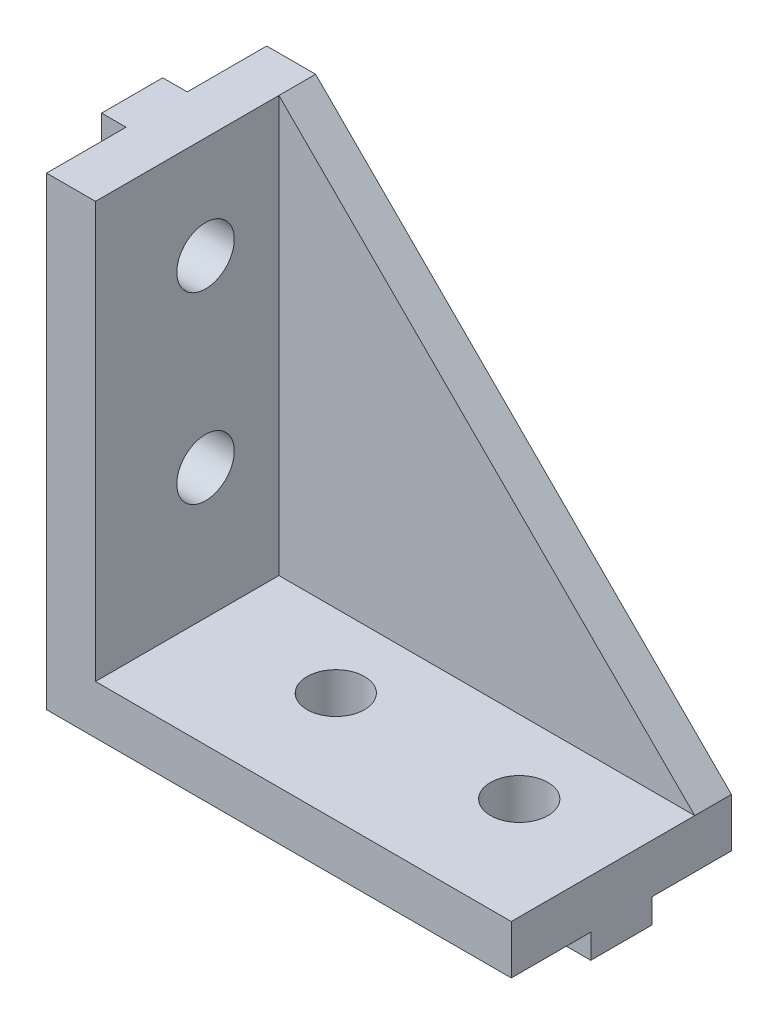
ISO-10303-21;
HEADER;
FILE_DESCRIPTION(('STEP AP214'),'2;1');
FILE_NAME('part.step','',(''),(''),'','','');
FILE_SCHEMA(('AUTOMOTIVE_DESIGN { 1 0 10303 214 1 1 1 1 }'));
ENDSEC;
DATA;
#1=APPLICATION_CONTEXT('core data for automotive mechanical design processes');
#2=APPLICATION_PROTOCOL_DEFINITION('international standard','automotive_design',2000,#1);
#3=PRODUCT_CONTEXT('',#1,'mechanical');
#4=PRODUCT('Part','Part','',(#3));
#5=PRODUCT_RELATED_PRODUCT_CATEGORY('part','',(#4));
#6=PRODUCT_DEFINITION_FORMATION('','',#4);
#7=PRODUCT_DEFINITION_CONTEXT('part definition',#1,'design');
#8=PRODUCT_DEFINITION('design','',#6,#7);
#9=PRODUCT_DEFINITION_SHAPE('','',#8);
#10=(LENGTH_UNIT() NAMED_UNIT(*) SI_UNIT(.MILLI.,.METRE.));
#11=(NAMED_UNIT(*) PLANE_ANGLE_UNIT() SI_UNIT($,.RADIAN.));
#12=(NAMED_UNIT(*) SI_UNIT($,.STERADIAN.) SOLID_ANGLE_UNIT());
#13=UNCERTAINTY_MEASURE_WITH_UNIT(LENGTH_MEASURE(1.E-05),#10,'distance_accuracy_value','');
#14=(GEOMETRIC_REPRESENTATION_CONTEXT(3) GLOBAL_UNCERTAINTY_ASSIGNED_CONTEXT((#13)) GLOBAL_UNIT_ASSIGNED_CONTEXT((#10,
#11,#12)) REPRESENTATION_CONTEXT('',''));
#15=CARTESIAN_POINT('',(0.,0.,0.));
#16=DIRECTION('',(0.,0.,1.));
#17=DIRECTION('',(1.,0.,0.));
#18=AXIS2_PLACEMENT_3D('',#15,#16,#17);
#19=CARTESIAN_POINT('',(0.,38.,9.));
#20=DIRECTION('',(1.,0.,0.));
#21=DIRECTION('',(0.,1.,0.));
#22=AXIS2_PLACEMENT_3D('',#19,#20,#21);
#23=PLANE('',#22);
#24=CARTESIAN_POINT('',(0.,29.65,0.));
#25=DIRECTION('',(-1.,0.,0.));
#26=DIRECTION('',(0.,0.,1.));
#27=AXIS2_PLACEMENT_3D('',#24,#25,#26);
#28=CIRCLE('',#27,2.35);
#29=CARTESIAN_POINT('',(0.,29.65,2.35));
#30=VERTEX_POINT('',#29);
#31=EDGE_CURVE('E267',#30,#30,#28,.T.);
#32=ORIENTED_EDGE('',*,*,#31,.F.);
#33=EDGE_LOOP('',(#32));
#34=FACE_BOUND('',#33,.T.);
#35=CARTESIAN_POINT('',(0.,14.65,0.));
#36=DIRECTION('',(-1.,0.,0.));
#37=DIRECTION('',(0.,0.,1.));
#38=AXIS2_PLACEMENT_3D('',#35,#36,#37);
#39=CIRCLE('',#38,2.35);
#40=CARTESIAN_POINT('',(0.,14.65,2.35));
#41=VERTEX_POINT('',#40);
#42=EDGE_CURVE('E260',#41,#41,#39,.T.);
#43=ORIENTED_EDGE('',*,*,#42,.F.);
#44=EDGE_LOOP('',(#43));
#45=FACE_BOUND('',#44,.T.);
#46=DIRECTION('',(0.,0.,-1.));
#47=VECTOR('',#46,1.);
#48=CARTESIAN_POINT('',(0.,36.,-2.49999999999998));
#49=LINE('',#48,#47);
#50=CARTESIAN_POINT('',(0.,36.,2.50000000000002));
#51=VERTEX_POINT('',#50);
#52=CARTESIAN_POINT('',(0.,36.,-2.49999999999998));
#53=VERTEX_POINT('',#52);
#54=EDGE_CURVE('E219',#51,#53,#49,.T.);
#55=ORIENTED_EDGE('',*,*,#54,.T.);
#56=DIRECTION('',(0.,1.,0.));
#57=VECTOR('',#56,1.);
#58=CARTESIAN_POINT('',(0.,36.,-2.49999999999998));
#59=LINE('',#58,#57);
#60=CARTESIAN_POINT('',(0.,38.,-2.49999999999998));
#61=VERTEX_POINT('',#60);
#62=EDGE_CURVE('E217',#53,#61,#59,.T.);
#63=ORIENTED_EDGE('',*,*,#62,.T.);
#64=DIRECTION('',(0.,0.,-1.));
#65=VECTOR('',#64,1.);
#66=CARTESIAN_POINT('',(0.,38.,9.));
#67=LINE('',#66,#65);
#68=CARTESIAN_POINT('',(0.,38.,-9.));
#69=VERTEX_POINT('',#68);
#70=EDGE_CURVE('E43',#61,#69,#67,.T.);
#71=ORIENTED_EDGE('',*,*,#70,.T.);
#72=DIRECTION('',(0.,-1.,0.));
#73=VECTOR('',#72,1.);
#74=CARTESIAN_POINT('',(0.,38.,-9.));
#75=LINE('',#74,#73);
#76=CARTESIAN_POINT('',(0.,0.,-9.));
#77=VERTEX_POINT('',#76);
#78=EDGE_CURVE('E356',#69,#77,#75,.T.);
#79=ORIENTED_EDGE('',*,*,#78,.T.);
#80=DIRECTION('',(0.,0.,-1.));
#81=VECTOR('',#80,1.);
#82=CARTESIAN_POINT('',(0.,0.,9.));
#83=LINE('',#82,#81);
#84=CARTESIAN_POINT('',(0.,0.,-2.5));
#85=VERTEX_POINT('',#84);
#86=EDGE_CURVE('E372',#85,#77,#83,.T.);
#87=ORIENTED_EDGE('',*,*,#86,.F.);
#88=DIRECTION('',(0.,1.,0.));
#89=VECTOR('',#88,1.);
#90=CARTESIAN_POINT('',(0.,0.,-2.5));
#91=LINE('',#90,#89);
#92=CARTESIAN_POINT('',(0.,2.,-2.5));
#93=VERTEX_POINT('',#92);
#94=EDGE_CURVE('E243',#85,#93,#91,.T.);
#95=ORIENTED_EDGE('',*,*,#94,.T.);
#96=DIRECTION('',(0.,0.,1.));
#97=VECTOR('',#96,1.);
#98=CARTESIAN_POINT('',(0.,2.,-2.5));
#99=LINE('',#98,#97);
#100=CARTESIAN_POINT('',(0.,2.,2.5));
#101=VERTEX_POINT('',#100);
#102=EDGE_CURVE('E195',#93,#101,#99,.T.);
#103=ORIENTED_EDGE('',*,*,#102,.T.);
#104=DIRECTION('',(0.,-1.,0.));
#105=VECTOR('',#104,1.);
#106=CARTESIAN_POINT('',(0.,0.,2.5));
#107=LINE('',#106,#105);
#108=CARTESIAN_POINT('',(0.,0.,2.5));
#109=VERTEX_POINT('',#108);
#110=EDGE_CURVE('E231',#101,#109,#107,.T.);
#111=ORIENTED_EDGE('',*,*,#110,.T.);
#112=CARTESIAN_POINT('',(0.,0.,9.));
#113=VERTEX_POINT('',#112);
#114=EDGE_CURVE('E373',#113,#109,#83,.T.);
#115=ORIENTED_EDGE('',*,*,#114,.F.);
#116=DIRECTION('',(0.,-1.,0.));
#117=VECTOR('',#116,1.);
#118=CARTESIAN_POINT('',(0.,38.,9.));
#119=LINE('',#118,#117);
#120=CARTESIAN_POINT('',(0.,38.,9.));
#121=VERTEX_POINT('',#120);
#122=EDGE_CURVE('E343',#121,#113,#119,.T.);
#123=ORIENTED_EDGE('',*,*,#122,.F.);
#124=CARTESIAN_POINT('',(0.,38.,2.50000000000002));
#125=VERTEX_POINT('',#124);
#126=EDGE_CURVE('E11',#121,#125,#67,.T.);
#127=ORIENTED_EDGE('',*,*,#126,.T.);
#128=DIRECTION('',(0.,-1.,0.));
#129=VECTOR('',#128,1.);
#130=CARTESIAN_POINT('',(0.,36.,2.50000000000002));
#131=LINE('',#130,#129);
#132=EDGE_CURVE('E206',#125,#51,#131,.T.);
#133=ORIENTED_EDGE('',*,*,#132,.T.);
#134=EDGE_LOOP('',(#55,#63,#71,#79,#87,#95,#103,#111,#115,#123,#127,#133));
#135=FACE_BOUND('',#134,.T.);
#136=ADVANCED_FACE('F35',(#34,#45,#135),#23,.F.);
#137=CARTESIAN_POINT('',(0.,0.,9.));
#138=DIRECTION('',(0.,1.,0.));
#139=DIRECTION('',(0.,0.,1.));
#140=AXIS2_PLACEMENT_3D('',#137,#138,#139);
#141=PLANE('',#140);
#142=CARTESIAN_POINT('',(14.65,0.,0.));
#143=DIRECTION('',(0.,1.,0.));
#144=DIRECTION('',(0.,0.,1.));
#145=AXIS2_PLACEMENT_3D('',#142,#143,#144);
#146=CIRCLE('',#145,2.35);
#147=CARTESIAN_POINT('',(14.65,0.,2.35));
#148=VERTEX_POINT('',#147);
#149=EDGE_CURVE('E328',#148,#148,#146,.T.);
#150=ORIENTED_EDGE('',*,*,#149,.T.);
#151=EDGE_LOOP('',(#150));
#152=FACE_BOUND('',#151,.T.);
#153=CARTESIAN_POINT('',(29.65,0.,0.));
#154=DIRECTION('',(0.,1.,0.));
#155=DIRECTION('',(0.,0.,1.));
#156=AXIS2_PLACEMENT_3D('',#153,#154,#155);
#157=CIRCLE('',#156,2.35);
#158=CARTESIAN_POINT('',(29.65,0.,2.35));
#159=VERTEX_POINT('',#158);
#160=EDGE_CURVE('E335',#159,#159,#157,.T.);
#161=ORIENTED_EDGE('',*,*,#160,.T.);
#162=EDGE_LOOP('',(#161));
#163=FACE_BOUND('',#162,.T.);
#164=DIRECTION('',(-1.,0.,0.));
#165=VECTOR('',#164,1.);
#166=CARTESIAN_POINT('',(36.,0.,2.50000000000002));
#167=LINE('',#166,#165);
#168=CARTESIAN_POINT('',(38.,0.,2.50000000000002));
#169=VERTEX_POINT('',#168);
#170=CARTESIAN_POINT('',(36.,0.,2.50000000000002));
#171=VERTEX_POINT('',#170);
#172=EDGE_CURVE('E263',#169,#171,#167,.T.);
#173=ORIENTED_EDGE('',*,*,#172,.F.);
#174=DIRECTION('',(0.,0.,-1.));
#175=VECTOR('',#174,1.);
#176=CARTESIAN_POINT('',(38.,0.,9.));
#177=LINE('',#176,#175);
#178=CARTESIAN_POINT('',(38.,0.,9.));
#179=VERTEX_POINT('',#178);
#180=EDGE_CURVE('E370',#179,#169,#177,.T.);
#181=ORIENTED_EDGE('',*,*,#180,.F.);
#182=DIRECTION('',(1.,0.,0.));
#183=VECTOR('',#182,1.);
#184=CARTESIAN_POINT('',(0.,0.,9.));
#185=LINE('',#184,#183);
#186=EDGE_CURVE('E346',#113,#179,#185,.T.);
#187=ORIENTED_EDGE('',*,*,#186,.F.);
#188=ORIENTED_EDGE('',*,*,#114,.T.);
#189=DIRECTION('',(-1.,0.,0.));
#190=VECTOR('',#189,1.);
#191=CARTESIAN_POINT('',(0.,0.,2.5));
#192=LINE('',#191,#190);
#193=CARTESIAN_POINT('',(2.,0.,2.5));
#194=VERTEX_POINT('',#193);
#195=EDGE_CURVE('E311',#194,#109,#192,.T.);
#196=ORIENTED_EDGE('',*,*,#195,.F.);
#197=DIRECTION('',(0.,0.,1.));
#198=VECTOR('',#197,1.);
#199=CARTESIAN_POINT('',(2.,0.,-2.5));
#200=LINE('',#199,#198);
#201=CARTESIAN_POINT('',(2.,0.,-2.5));
#202=VERTEX_POINT('',#201);
#203=EDGE_CURVE('E297',#202,#194,#200,.T.);
#204=ORIENTED_EDGE('',*,*,#203,.F.);
#205=DIRECTION('',(1.,0.,0.));
#206=VECTOR('',#205,1.);
#207=CARTESIAN_POINT('',(0.,0.,-2.5));
#208=LINE('',#207,#206);
#209=EDGE_CURVE('E302',#85,#202,#208,.T.);
#210=ORIENTED_EDGE('',*,*,#209,.F.);
#211=ORIENTED_EDGE('',*,*,#86,.T.);
#212=DIRECTION('',(1.,0.,0.));
#213=VECTOR('',#212,1.);
#214=CARTESIAN_POINT('',(0.,0.,-9.));
#215=LINE('',#214,#213);
#216=CARTESIAN_POINT('',(38.,0.,-9.));
#217=VERTEX_POINT('',#216);
#218=EDGE_CURVE('E359',#77,#217,#215,.T.);
#219=ORIENTED_EDGE('',*,*,#218,.T.);
#220=CARTESIAN_POINT('',(38.,0.,-2.49999999999998));
#221=VERTEX_POINT('',#220);
#222=EDGE_CURVE('E369',#221,#217,#177,.T.);
#223=ORIENTED_EDGE('',*,*,#222,.F.);
#224=DIRECTION('',(1.,0.,0.));
#225=VECTOR('',#224,1.);
#226=CARTESIAN_POINT('',(36.,0.,-2.49999999999998));
#227=LINE('',#226,#225);
#228=CARTESIAN_POINT('',(36.,0.,-2.49999999999998));
#229=VERTEX_POINT('',#228);
#230=EDGE_CURVE('E276',#229,#221,#227,.T.);
#231=ORIENTED_EDGE('',*,*,#230,.F.);
#232=DIRECTION('',(0.,0.,-1.));
#233=VECTOR('',#232,1.);
#234=CARTESIAN_POINT('',(36.,0.,-2.49999999999998));
#235=LINE('',#234,#233);
#236=EDGE_CURVE('E284',#171,#229,#235,.T.);
#237=ORIENTED_EDGE('',*,*,#236,.F.);
#238=EDGE_LOOP('',(#173,#181,#187,#188,#196,#204,#210,#211,#219,#223,#231,#237));
#239=FACE_BOUND('',#238,.T.);
#240=ADVANCED_FACE('F381',(#152,#163,#239),#141,.F.);
#241=CARTESIAN_POINT('',(4.,38.,9.));
#242=DIRECTION('',(0.,-1.,0.));
#243=DIRECTION('',(0.,0.,-1.));
#244=AXIS2_PLACEMENT_3D('',#241,#242,#243);
#245=PLANE('',#244);
#246=DIRECTION('',(-1.,0.,0.));
#247=VECTOR('',#246,1.);
#248=CARTESIAN_POINT('',(4.,38.,-9.));
#249=LINE('',#248,#247);
#250=CARTESIAN_POINT('',(4.,38.,-9.));
#251=VERTEX_POINT('',#250);
#252=EDGE_CURVE('E331',#251,#69,#249,.T.);
#253=ORIENTED_EDGE('',*,*,#252,.T.);
#254=ORIENTED_EDGE('',*,*,#70,.F.);
#255=DIRECTION('',(1.,0.,0.));
#256=VECTOR('',#255,1.);
#257=CARTESIAN_POINT('',(-1.99999999999999,38.,-2.49999999999998));
#258=LINE('',#257,#256);
#259=CARTESIAN_POINT('',(-1.99999999999999,38.,-2.49999999999998));
#260=VERTEX_POINT('',#259);
#261=EDGE_CURVE('E185',#260,#61,#258,.T.);
#262=ORIENTED_EDGE('',*,*,#261,.F.);
#263=DIRECTION('',(0.,0.,1.));
#264=VECTOR('',#263,1.);
#265=CARTESIAN_POINT('',(-1.99999999999999,38.,-2.49999999999998));
#266=LINE('',#265,#264);
#267=CARTESIAN_POINT('',(-1.99999999999999,38.,2.50000000000002));
#268=VERTEX_POINT('',#267);
#269=EDGE_CURVE('E189',#260,#268,#266,.T.);
#270=ORIENTED_EDGE('',*,*,#269,.T.);
#271=DIRECTION('',(1.,0.,0.));
#272=VECTOR('',#271,1.);
#273=CARTESIAN_POINT('',(-1.99999999999999,38.,2.50000000000002));
#274=LINE('',#273,#272);
#275=EDGE_CURVE('E216',#268,#125,#274,.T.);
#276=ORIENTED_EDGE('',*,*,#275,.T.);
#277=ORIENTED_EDGE('',*,*,#126,.F.);
#278=DIRECTION('',(-1.,0.,0.));
#279=VECTOR('',#278,1.);
#280=CARTESIAN_POINT('',(4.,38.,9.));
#281=LINE('',#280,#279);
#282=CARTESIAN_POINT('',(4.,38.,9.));
#283=VERTEX_POINT('',#282);
#284=EDGE_CURVE('E340',#283,#121,#281,.T.);
#285=ORIENTED_EDGE('',*,*,#284,.F.);
#286=DIRECTION('',(0.,0.,-1.));
#287=VECTOR('',#286,1.);
#288=CARTESIAN_POINT('',(4.,38.,9.));
#289=LINE('',#288,#287);
#290=CARTESIAN_POINT('',(4.,38.,-6.));
#291=VERTEX_POINT('',#290);
#292=EDGE_CURVE('E354',#283,#291,#289,.T.);
#293=ORIENTED_EDGE('',*,*,#292,.T.);
#294=DIRECTION('',(0.,0.,-1.));
#295=VECTOR('',#294,1.);
#296=CARTESIAN_POINT('',(4.,38.,-6.));
#297=LINE('',#296,#295);
#298=EDGE_CURVE('E400',#291,#251,#297,.T.);
#299=ORIENTED_EDGE('',*,*,#298,.T.);
#300=EDGE_LOOP('',(#253,#254,#262,#270,#276,#277,#285,#293,#299));
#301=FACE_BOUND('',#300,.T.);
#302=ADVANCED_FACE('F37',(#301),#245,.F.);
#303=DIRECTION('',(0.,1.,0.));
#304=VECTOR('',#303,1.);
#305=CARTESIAN_POINT('',(0.,-2.,2.5));
#306=LINE('',#305,#304);
#307=CARTESIAN_POINT('',(0.,-2.,2.5));
#308=VERTEX_POINT('',#307);
#309=EDGE_CURVE('E321',#308,#109,#306,.T.);
#310=ORIENTED_EDGE('',*,*,#309,.T.);
#311=DIRECTION('',(0.,0.,-1.));
#312=VECTOR('',#311,1.);
#313=CARTESIAN_POINT('',(0.,0.,-2.5));
#314=LINE('',#313,#312);
#315=EDGE_CURVE('E246',#109,#85,#314,.T.);
#316=ORIENTED_EDGE('',*,*,#315,.T.);
#317=DIRECTION('',(0.,1.,0.));
#318=VECTOR('',#317,1.);
#319=CARTESIAN_POINT('',(0.,-2.,-2.5));
#320=LINE('',#319,#318);
#321=CARTESIAN_POINT('',(0.,-2.,-2.5));
#322=VERTEX_POINT('',#321);
#323=EDGE_CURVE('E318',#322,#85,#320,.T.);
#324=ORIENTED_EDGE('',*,*,#323,.F.);
#325=DIRECTION('',(0.,0.,-1.));
#326=VECTOR('',#325,1.);
#327=CARTESIAN_POINT('',(0.,-2.,-2.5));
#328=LINE('',#327,#326);
#329=EDGE_CURVE('E304',#308,#322,#328,.T.);
#330=ORIENTED_EDGE('',*,*,#329,.F.);
#331=EDGE_LOOP('',(#310,#316,#324,#330));
#332=FACE_BOUND('',#331,.T.);
#333=ADVANCED_FACE('F430',(#332),#23,.F.);
#334=CARTESIAN_POINT('',(38.,0.,9.));
#335=DIRECTION('',(-1.,0.,0.));
#336=DIRECTION('',(0.,0.,1.));
#337=AXIS2_PLACEMENT_3D('',#334,#335,#336);
#338=PLANE('',#337);
#339=DIRECTION('',(0.,1.,0.));
#340=VECTOR('',#339,1.);
#341=CARTESIAN_POINT('',(38.,0.,-9.));
#342=LINE('',#341,#340);
#343=CARTESIAN_POINT('',(38.,4.,-9.));
#344=VERTEX_POINT('',#343);
#345=EDGE_CURVE('E344',#217,#344,#342,.T.);
#346=ORIENTED_EDGE('',*,*,#345,.T.);
#347=DIRECTION('',(0.,0.,-1.));
#348=VECTOR('',#347,1.);
#349=CARTESIAN_POINT('',(38.,4.,-6.));
#350=LINE('',#349,#348);
#351=CARTESIAN_POINT('',(38.,4.,-6.));
#352=VERTEX_POINT('',#351);
#353=EDGE_CURVE('E50',#352,#344,#350,.T.);
#354=ORIENTED_EDGE('',*,*,#353,.F.);
#355=DIRECTION('',(0.,0.,-1.));
#356=VECTOR('',#355,1.);
#357=CARTESIAN_POINT('',(38.,4.,9.));
#358=LINE('',#357,#356);
#359=CARTESIAN_POINT('',(38.,4.,9.));
#360=VERTEX_POINT('',#359);
#361=EDGE_CURVE('E367',#360,#352,#358,.T.);
#362=ORIENTED_EDGE('',*,*,#361,.F.);
#363=DIRECTION('',(0.,1.,0.));
#364=VECTOR('',#363,1.);
#365=CARTESIAN_POINT('',(38.,0.,9.));
#366=LINE('',#365,#364);
#367=EDGE_CURVE('E348',#179,#360,#366,.T.);
#368=ORIENTED_EDGE('',*,*,#367,.F.);
#369=ORIENTED_EDGE('',*,*,#180,.T.);
#370=DIRECTION('',(0.,1.,0.));
#371=VECTOR('',#370,1.);
#372=CARTESIAN_POINT('',(38.,-2.,2.50000000000002));
#373=LINE('',#372,#371);
#374=CARTESIAN_POINT('',(38.,-2.,2.50000000000002));
#375=VERTEX_POINT('',#374);
#376=EDGE_CURVE('E295',#375,#169,#373,.T.);
#377=ORIENTED_EDGE('',*,*,#376,.F.);
#378=DIRECTION('',(0.,0.,1.));
#379=VECTOR('',#378,1.);
#380=CARTESIAN_POINT('',(38.,-2.,-2.49999999999998));
#381=LINE('',#380,#379);
#382=CARTESIAN_POINT('',(38.,-2.,-2.49999999999998));
#383=VERTEX_POINT('',#382);
#384=EDGE_CURVE('E272',#383,#375,#381,.T.);
#385=ORIENTED_EDGE('',*,*,#384,.F.);
#386=DIRECTION('',(0.,1.,0.));
#387=VECTOR('',#386,1.);
#388=CARTESIAN_POINT('',(38.,-2.,-2.49999999999998));
#389=LINE('',#388,#387);
#390=EDGE_CURVE('E282',#383,#221,#389,.T.);
#391=ORIENTED_EDGE('',*,*,#390,.T.);
#392=ORIENTED_EDGE('',*,*,#222,.T.);
#393=EDGE_LOOP('',(#346,#354,#362,#368,#369,#377,#385,#391,#392));
#394=FACE_BOUND('',#393,.T.);
#395=ADVANCED_FACE('F393',(#394),#338,.F.);
#396=CARTESIAN_POINT('',(4.,4.,9.));
#397=DIRECTION('',(0.,-1.,0.));
#398=DIRECTION('',(0.,0.,-1.));
#399=AXIS2_PLACEMENT_3D('',#396,#397,#398);
#400=PLANE('',#399);
#401=CARTESIAN_POINT('',(14.65,4.,0.));
#402=DIRECTION('',(0.,1.,0.));
#403=DIRECTION('',(0.,0.,1.));
#404=AXIS2_PLACEMENT_3D('',#401,#402,#403);
#405=CIRCLE('',#404,2.35);
#406=CARTESIAN_POINT('',(14.65,4.,2.35));
#407=VERTEX_POINT('',#406);
#408=EDGE_CURVE('E332',#407,#407,#405,.T.);
#409=ORIENTED_EDGE('',*,*,#408,.F.);
#410=EDGE_LOOP('',(#409));
#411=FACE_BOUND('',#410,.T.);
#412=CARTESIAN_POINT('',(29.65,4.,0.));
#413=DIRECTION('',(0.,1.,0.));
#414=DIRECTION('',(0.,0.,1.));
#415=AXIS2_PLACEMENT_3D('',#412,#413,#414);
#416=CIRCLE('',#415,2.35);
#417=CARTESIAN_POINT('',(29.65,4.,2.35));
#418=VERTEX_POINT('',#417);
#419=EDGE_CURVE('E327',#418,#418,#416,.T.);
#420=ORIENTED_EDGE('',*,*,#419,.F.);
#421=EDGE_LOOP('',(#420));
#422=FACE_BOUND('',#421,.T.);
#423=ORIENTED_EDGE('',*,*,#361,.T.);
#424=DIRECTION('',(1.,0.,0.));
#425=VECTOR('',#424,1.);
#426=CARTESIAN_POINT('',(38.,4.,-6.));
#427=LINE('',#426,#425);
#428=CARTESIAN_POINT('',(4.,4.,-6.));
#429=VERTEX_POINT('',#428);
#430=EDGE_CURVE('E57',#429,#352,#427,.T.);
#431=ORIENTED_EDGE('',*,*,#430,.F.);
#432=DIRECTION('',(0.,0.,-1.));
#433=VECTOR('',#432,1.);
#434=CARTESIAN_POINT('',(4.,4.,9.));
#435=LINE('',#434,#433);
#436=CARTESIAN_POINT('',(4.,4.,9.));
#437=VERTEX_POINT('',#436);
#438=EDGE_CURVE('E365',#437,#429,#435,.T.);
#439=ORIENTED_EDGE('',*,*,#438,.F.);
#440=DIRECTION('',(-1.,0.,0.));
#441=VECTOR('',#440,1.);
#442=CARTESIAN_POINT('',(4.,4.,9.));
#443=LINE('',#442,#441);
#444=EDGE_CURVE('E350',#360,#437,#443,.T.);
#445=ORIENTED_EDGE('',*,*,#444,.F.);
#446=EDGE_LOOP('',(#423,#431,#439,#445));
#447=FACE_BOUND('',#446,.T.);
#448=ADVANCED_FACE('F420',(#411,#422,#447),#400,.F.);
#449=CARTESIAN_POINT('',(4.,38.,9.));
#450=DIRECTION('',(-1.,0.,0.));
#451=DIRECTION('',(0.,-1.,0.));
#452=AXIS2_PLACEMENT_3D('',#449,#450,#451);
#453=PLANE('',#452);
#454=CARTESIAN_POINT('',(4.,14.65,0.));
#455=DIRECTION('',(-1.,0.,0.));
#456=DIRECTION('',(0.,0.,1.));
#457=AXIS2_PLACEMENT_3D('',#454,#455,#456);
#458=CIRCLE('',#457,2.35);
#459=CARTESIAN_POINT('',(4.,14.65,2.35));
#460=VERTEX_POINT('',#459);
#461=EDGE_CURVE('E264',#460,#460,#458,.T.);
#462=ORIENTED_EDGE('',*,*,#461,.T.);
#463=EDGE_LOOP('',(#462));
#464=FACE_BOUND('',#463,.T.);
#465=CARTESIAN_POINT('',(4.00000000000001,29.65,0.));
#466=DIRECTION('',(-1.,0.,0.));
#467=DIRECTION('',(0.,0.,1.));
#468=AXIS2_PLACEMENT_3D('',#465,#466,#467);
#469=CIRCLE('',#468,2.35);
#470=CARTESIAN_POINT('',(4.00000000000001,29.65,2.35));
#471=VERTEX_POINT('',#470);
#472=EDGE_CURVE('E259',#471,#471,#469,.T.);
#473=ORIENTED_EDGE('',*,*,#472,.T.);
#474=EDGE_LOOP('',(#473));
#475=FACE_BOUND('',#474,.T.);
#476=ORIENTED_EDGE('',*,*,#438,.T.);
#477=DIRECTION('',(0.,-1.,0.));
#478=VECTOR('',#477,1.);
#479=CARTESIAN_POINT('',(4.,4.,-6.));
#480=LINE('',#479,#478);
#481=EDGE_CURVE('E404',#291,#429,#480,.T.);
#482=ORIENTED_EDGE('',*,*,#481,.F.);
#483=ORIENTED_EDGE('',*,*,#292,.F.);
#484=DIRECTION('',(0.,1.,0.));
#485=VECTOR('',#484,1.);
#486=CARTESIAN_POINT('',(4.,38.,9.));
#487=LINE('',#486,#485);
#488=EDGE_CURVE('E352',#437,#283,#487,.T.);
#489=ORIENTED_EDGE('',*,*,#488,.F.);
#490=EDGE_LOOP('',(#476,#482,#483,#489));
#491=FACE_BOUND('',#490,.T.);
#492=ADVANCED_FACE('F412',(#464,#475,#491),#453,.F.);
#493=CARTESIAN_POINT('',(0.,0.,9.));
#494=DIRECTION('',(0.,0.,1.));
#495=DIRECTION('',(1.,0.,0.));
#496=AXIS2_PLACEMENT_3D('',#493,#494,#495);
#497=PLANE('',#496);
#498=ORIENTED_EDGE('',*,*,#284,.T.);
#499=ORIENTED_EDGE('',*,*,#122,.T.);
#500=ORIENTED_EDGE('',*,*,#186,.T.);
#501=ORIENTED_EDGE('',*,*,#367,.T.);
#502=ORIENTED_EDGE('',*,*,#444,.T.);
#503=ORIENTED_EDGE('',*,*,#488,.T.);
#504=EDGE_LOOP('',(#498,#499,#500,#501,#502,#503));
#505=FACE_BOUND('',#504,.T.);
#506=ADVANCED_FACE('F417',(#505),#497,.T.);
#507=CARTESIAN_POINT('',(0.,0.,-9.));
#508=DIRECTION('',(0.,0.,1.));
#509=DIRECTION('',(1.,0.,0.));
#510=AXIS2_PLACEMENT_3D('',#507,#508,#509);
#511=PLANE('',#510);
#512=ORIENTED_EDGE('',*,*,#252,.F.);
#513=DIRECTION('',(-0.707106781186547,0.707106781186547,0.));
#514=VECTOR('',#513,1.);
#515=CARTESIAN_POINT('',(4.,38.,-9.));
#516=LINE('',#515,#514);
#517=EDGE_CURVE('E392',#344,#251,#516,.T.);
#518=ORIENTED_EDGE('',*,*,#517,.F.);
#519=ORIENTED_EDGE('',*,*,#345,.F.);
#520=ORIENTED_EDGE('',*,*,#218,.F.);
#521=ORIENTED_EDGE('',*,*,#78,.F.);
#522=EDGE_LOOP('',(#512,#518,#519,#520,#521));
#523=FACE_BOUND('',#522,.T.);
#524=ADVANCED_FACE('F389',(#523),#511,.F.);
#525=CARTESIAN_POINT('',(29.65,0.,0.));
#526=DIRECTION('',(0.,1.,0.));
#527=DIRECTION('',(0.,0.,1.));
#528=AXIS2_PLACEMENT_3D('',#525,#526,#527);
#529=CYLINDRICAL_SURFACE('',#528,2.35);
#530=ORIENTED_EDGE('',*,*,#160,.F.);
#531=EDGE_LOOP('',(#530));
#532=FACE_BOUND('',#531,.T.);
#533=ORIENTED_EDGE('',*,*,#419,.T.);
#534=EDGE_LOOP('',(#533));
#535=FACE_BOUND('',#534,.T.);
#536=ADVANCED_FACE('F484',(#532,#535),#529,.F.);
#537=CARTESIAN_POINT('',(14.65,0.,0.));
#538=DIRECTION('',(0.,1.,0.));
#539=DIRECTION('',(0.,0.,1.));
#540=AXIS2_PLACEMENT_3D('',#537,#538,#539);
#541=CYLINDRICAL_SURFACE('',#540,2.35);
#542=ORIENTED_EDGE('',*,*,#149,.F.);
#543=EDGE_LOOP('',(#542));
#544=FACE_BOUND('',#543,.T.);
#545=ORIENTED_EDGE('',*,*,#408,.T.);
#546=EDGE_LOOP('',(#545));
#547=FACE_BOUND('',#546,.T.);
#548=ADVANCED_FACE('F481',(#544,#547),#541,.F.);
#549=CARTESIAN_POINT('',(2.,-2.,-2.5));
#550=DIRECTION('',(-1.,0.,0.));
#551=DIRECTION('',(0.,0.,1.));
#552=AXIS2_PLACEMENT_3D('',#549,#550,#551);
#553=PLANE('',#552);
#554=ORIENTED_EDGE('',*,*,#203,.T.);
#555=DIRECTION('',(0.,1.,0.));
#556=VECTOR('',#555,1.);
#557=CARTESIAN_POINT('',(2.,-2.,2.5));
#558=LINE('',#557,#556);
#559=CARTESIAN_POINT('',(2.,-2.,2.5));
#560=VERTEX_POINT('',#559);
#561=EDGE_CURVE('E324',#560,#194,#558,.T.);
#562=ORIENTED_EDGE('',*,*,#561,.F.);
#563=DIRECTION('',(0.,0.,1.));
#564=VECTOR('',#563,1.);
#565=CARTESIAN_POINT('',(2.,-2.,-2.5));
#566=LINE('',#565,#564);
#567=CARTESIAN_POINT('',(2.,-2.,-2.5));
#568=VERTEX_POINT('',#567);
#569=EDGE_CURVE('E298',#568,#560,#566,.T.);
#570=ORIENTED_EDGE('',*,*,#569,.F.);
#571=DIRECTION('',(0.,1.,0.));
#572=VECTOR('',#571,1.);
#573=CARTESIAN_POINT('',(2.,-2.,-2.5));
#574=LINE('',#573,#572);
#575=EDGE_CURVE('E308',#568,#202,#574,.T.);
#576=ORIENTED_EDGE('',*,*,#575,.T.);
#577=EDGE_LOOP('',(#554,#562,#570,#576));
#578=FACE_BOUND('',#577,.T.);
#579=ADVANCED_FACE('F461',(#578),#553,.F.);
#580=CARTESIAN_POINT('',(0.,-2.,2.5));
#581=DIRECTION('',(0.,0.,-1.));
#582=DIRECTION('',(-1.,0.,0.));
#583=AXIS2_PLACEMENT_3D('',#580,#581,#582);
#584=PLANE('',#583);
#585=ORIENTED_EDGE('',*,*,#195,.T.);
#586=ORIENTED_EDGE('',*,*,#309,.F.);
#587=DIRECTION('',(-1.,0.,0.));
#588=VECTOR('',#587,1.);
#589=CARTESIAN_POINT('',(0.,-2.,2.5));
#590=LINE('',#589,#588);
#591=EDGE_CURVE('E301',#560,#308,#590,.T.);
#592=ORIENTED_EDGE('',*,*,#591,.F.);
#593=ORIENTED_EDGE('',*,*,#561,.T.);
#594=EDGE_LOOP('',(#585,#586,#592,#593));
#595=FACE_BOUND('',#594,.T.);
#596=ADVANCED_FACE('F453',(#595),#584,.F.);
#597=CARTESIAN_POINT('',(0.,-2.,-2.5));
#598=DIRECTION('',(0.,0.,1.));
#599=DIRECTION('',(1.,0.,0.));
#600=AXIS2_PLACEMENT_3D('',#597,#598,#599);
#601=PLANE('',#600);
#602=ORIENTED_EDGE('',*,*,#209,.T.);
#603=ORIENTED_EDGE('',*,*,#575,.F.);
#604=DIRECTION('',(1.,0.,0.));
#605=VECTOR('',#604,1.);
#606=CARTESIAN_POINT('',(0.,-2.,-2.5));
#607=LINE('',#606,#605);
#608=EDGE_CURVE('E306',#322,#568,#607,.T.);
#609=ORIENTED_EDGE('',*,*,#608,.F.);
#610=ORIENTED_EDGE('',*,*,#323,.T.);
#611=EDGE_LOOP('',(#602,#603,#609,#610));
#612=FACE_BOUND('',#611,.T.);
#613=ADVANCED_FACE('F458',(#612),#601,.F.);
#614=CARTESIAN_POINT('',(0.,-2.,0.));
#615=DIRECTION('',(0.,1.,0.));
#616=DIRECTION('',(0.,0.,1.));
#617=AXIS2_PLACEMENT_3D('',#614,#615,#616);
#618=PLANE('',#617);
#619=ORIENTED_EDGE('',*,*,#569,.T.);
#620=ORIENTED_EDGE('',*,*,#591,.T.);
#621=ORIENTED_EDGE('',*,*,#329,.T.);
#622=ORIENTED_EDGE('',*,*,#608,.T.);
#623=EDGE_LOOP('',(#619,#620,#621,#622));
#624=FACE_BOUND('',#623,.T.);
#625=ADVANCED_FACE('F463',(#624),#618,.F.);
#626=CARTESIAN_POINT('',(36.,-2.,2.50000000000002));
#627=DIRECTION('',(0.,0.,-1.));
#628=DIRECTION('',(-1.,0.,0.));
#629=AXIS2_PLACEMENT_3D('',#626,#627,#628);
#630=PLANE('',#629);
#631=ORIENTED_EDGE('',*,*,#172,.T.);
#632=DIRECTION('',(0.,1.,0.));
#633=VECTOR('',#632,1.);
#634=CARTESIAN_POINT('',(36.,-2.,2.50000000000002));
#635=LINE('',#634,#633);
#636=CARTESIAN_POINT('',(36.,-2.,2.50000000000002));
#637=VERTEX_POINT('',#636);
#638=EDGE_CURVE('E292',#637,#171,#635,.T.);
#639=ORIENTED_EDGE('',*,*,#638,.F.);
#640=DIRECTION('',(-1.,0.,0.));
#641=VECTOR('',#640,1.);
#642=CARTESIAN_POINT('',(36.,-2.,2.50000000000002));
#643=LINE('',#642,#641);
#644=EDGE_CURVE('E275',#375,#637,#643,.T.);
#645=ORIENTED_EDGE('',*,*,#644,.F.);
#646=ORIENTED_EDGE('',*,*,#376,.T.);
#647=EDGE_LOOP('',(#631,#639,#645,#646));
#648=FACE_BOUND('',#647,.T.);
#649=ADVANCED_FACE('F465',(#648),#630,.F.);
#650=CARTESIAN_POINT('',(36.,-2.,-2.49999999999998));
#651=DIRECTION('',(1.,0.,0.));
#652=DIRECTION('',(0.,0.,-1.));
#653=AXIS2_PLACEMENT_3D('',#650,#651,#652);
#654=PLANE('',#653);
#655=ORIENTED_EDGE('',*,*,#236,.T.);
#656=DIRECTION('',(0.,1.,0.));
#657=VECTOR('',#656,1.);
#658=CARTESIAN_POINT('',(36.,-2.,-2.49999999999998));
#659=LINE('',#658,#657);
#660=CARTESIAN_POINT('',(36.,-2.,-2.49999999999998));
#661=VERTEX_POINT('',#660);
#662=EDGE_CURVE('E289',#661,#229,#659,.T.);
#663=ORIENTED_EDGE('',*,*,#662,.F.);
#664=DIRECTION('',(0.,0.,-1.));
#665=VECTOR('',#664,1.);
#666=CARTESIAN_POINT('',(36.,-2.,-2.49999999999998));
#667=LINE('',#666,#665);
#668=EDGE_CURVE('E278',#637,#661,#667,.T.);
#669=ORIENTED_EDGE('',*,*,#668,.F.);
#670=ORIENTED_EDGE('',*,*,#638,.T.);
#671=EDGE_LOOP('',(#655,#663,#669,#670));
#672=FACE_BOUND('',#671,.T.);
#673=ADVANCED_FACE('F471',(#672),#654,.F.);
#674=CARTESIAN_POINT('',(36.,-2.,-2.49999999999998));
#675=DIRECTION('',(0.,0.,1.));
#676=DIRECTION('',(1.,0.,0.));
#677=AXIS2_PLACEMENT_3D('',#674,#675,#676);
#678=PLANE('',#677);
#679=ORIENTED_EDGE('',*,*,#230,.T.);
#680=ORIENTED_EDGE('',*,*,#390,.F.);
#681=DIRECTION('',(1.,0.,0.));
#682=VECTOR('',#681,1.);
#683=CARTESIAN_POINT('',(36.,-2.,-2.49999999999998));
#684=LINE('',#683,#682);
#685=EDGE_CURVE('E280',#661,#383,#684,.T.);
#686=ORIENTED_EDGE('',*,*,#685,.F.);
#687=ORIENTED_EDGE('',*,*,#662,.T.);
#688=EDGE_LOOP('',(#679,#680,#686,#687));
#689=FACE_BOUND('',#688,.T.);
#690=ADVANCED_FACE('F695',(#689),#678,.F.);
#691=CARTESIAN_POINT('',(0.,-2.,0.));
#692=DIRECTION('',(0.,1.,0.));
#693=DIRECTION('',(0.,0.,1.));
#694=AXIS2_PLACEMENT_3D('',#691,#692,#693);
#695=PLANE('',#694);
#696=ORIENTED_EDGE('',*,*,#384,.T.);
#697=ORIENTED_EDGE('',*,*,#644,.T.);
#698=ORIENTED_EDGE('',*,*,#668,.T.);
#699=ORIENTED_EDGE('',*,*,#685,.T.);
#700=EDGE_LOOP('',(#696,#697,#698,#699));
#701=FACE_BOUND('',#700,.T.);
#702=ADVANCED_FACE('F530',(#701),#695,.F.);
#703=CARTESIAN_POINT('',(0.,29.65,0.));
#704=DIRECTION('',(1.,0.,0.));
#705=DIRECTION('',(0.,1.,0.));
#706=AXIS2_PLACEMENT_3D('',#703,#704,#705);
#707=CYLINDRICAL_SURFACE('',#706,2.35);
#708=ORIENTED_EDGE('',*,*,#31,.T.);
#709=EDGE_LOOP('',(#708));
#710=FACE_BOUND('',#709,.T.);
#711=ORIENTED_EDGE('',*,*,#472,.F.);
#712=EDGE_LOOP('',(#711));
#713=FACE_BOUND('',#712,.T.);
#714=ADVANCED_FACE('F524',(#710,#713),#707,.F.);
#715=CARTESIAN_POINT('',(0.,14.65,0.));
#716=DIRECTION('',(1.,0.,0.));
#717=DIRECTION('',(0.,1.,0.));
#718=AXIS2_PLACEMENT_3D('',#715,#716,#717);
#719=CYLINDRICAL_SURFACE('',#718,2.35);
#720=ORIENTED_EDGE('',*,*,#42,.T.);
#721=EDGE_LOOP('',(#720));
#722=FACE_BOUND('',#721,.T.);
#723=ORIENTED_EDGE('',*,*,#461,.F.);
#724=EDGE_LOOP('',(#723));
#725=FACE_BOUND('',#724,.T.);
#726=ADVANCED_FACE('F529',(#722,#725),#719,.F.);
#727=CARTESIAN_POINT('',(-2.,2.,-2.5));
#728=DIRECTION('',(0.,1.,0.));
#729=DIRECTION('',(-1.,0.,0.));
#730=AXIS2_PLACEMENT_3D('',#727,#728,#729);
#731=PLANE('',#730);
#732=ORIENTED_EDGE('',*,*,#102,.F.);
#733=DIRECTION('',(1.,0.,0.));
#734=VECTOR('',#733,1.);
#735=CARTESIAN_POINT('',(-2.,2.,-2.5));
#736=LINE('',#735,#734);
#737=CARTESIAN_POINT('',(-2.,2.,-2.5));
#738=VERTEX_POINT('',#737);
#739=EDGE_CURVE('E256',#738,#93,#736,.T.);
#740=ORIENTED_EDGE('',*,*,#739,.F.);
#741=DIRECTION('',(0.,0.,1.));
#742=VECTOR('',#741,1.);
#743=CARTESIAN_POINT('',(-2.,2.,-2.5));
#744=LINE('',#743,#742);
#745=CARTESIAN_POINT('',(-2.,2.,2.5));
#746=VERTEX_POINT('',#745);
#747=EDGE_CURVE('E227',#738,#746,#744,.T.);
#748=ORIENTED_EDGE('',*,*,#747,.T.);
#749=DIRECTION('',(1.,0.,0.));
#750=VECTOR('',#749,1.);
#751=CARTESIAN_POINT('',(-2.,2.,2.5));
#752=LINE('',#751,#750);
#753=EDGE_CURVE('E240',#746,#101,#752,.T.);
#754=ORIENTED_EDGE('',*,*,#753,.T.);
#755=EDGE_LOOP('',(#732,#740,#748,#754));
#756=FACE_BOUND('',#755,.T.);
#757=ADVANCED_FACE('F542',(#756),#731,.T.);
#758=CARTESIAN_POINT('',(-2.,0.,-2.5));
#759=DIRECTION('',(0.,0.,-1.));
#760=DIRECTION('',(-1.,0.,0.));
#761=AXIS2_PLACEMENT_3D('',#758,#759,#760);
#762=PLANE('',#761);
#763=ORIENTED_EDGE('',*,*,#94,.F.);
#764=DIRECTION('',(1.,0.,0.));
#765=VECTOR('',#764,1.);
#766=CARTESIAN_POINT('',(-2.,0.,-2.5));
#767=LINE('',#766,#765);
#768=CARTESIAN_POINT('',(-2.,0.,-2.5));
#769=VERTEX_POINT('',#768);
#770=EDGE_CURVE('E254',#769,#85,#767,.T.);
#771=ORIENTED_EDGE('',*,*,#770,.F.);
#772=DIRECTION('',(0.,1.,0.));
#773=VECTOR('',#772,1.);
#774=CARTESIAN_POINT('',(-2.,0.,-2.5));
#775=LINE('',#774,#773);
#776=EDGE_CURVE('E230',#769,#738,#775,.T.);
#777=ORIENTED_EDGE('',*,*,#776,.T.);
#778=ORIENTED_EDGE('',*,*,#739,.T.);
#779=EDGE_LOOP('',(#763,#771,#777,#778));
#780=FACE_BOUND('',#779,.T.);
#781=ADVANCED_FACE('F553',(#780),#762,.T.);
#782=CARTESIAN_POINT('',(-2.,0.,-2.5));
#783=DIRECTION('',(0.,-1.,0.));
#784=DIRECTION('',(1.,0.,0.));
#785=AXIS2_PLACEMENT_3D('',#782,#783,#784);
#786=PLANE('',#785);
#787=ORIENTED_EDGE('',*,*,#315,.F.);
#788=DIRECTION('',(1.,0.,0.));
#789=VECTOR('',#788,1.);
#790=CARTESIAN_POINT('',(-2.,0.,2.5));
#791=LINE('',#790,#789);
#792=CARTESIAN_POINT('',(-2.,0.,2.5));
#793=VERTEX_POINT('',#792);
#794=EDGE_CURVE('E252',#793,#109,#791,.T.);
#795=ORIENTED_EDGE('',*,*,#794,.F.);
#796=DIRECTION('',(0.,0.,-1.));
#797=VECTOR('',#796,1.);
#798=CARTESIAN_POINT('',(-2.,0.,-2.5));
#799=LINE('',#798,#797);
#800=EDGE_CURVE('E234',#793,#769,#799,.T.);
#801=ORIENTED_EDGE('',*,*,#800,.T.);
#802=ORIENTED_EDGE('',*,*,#770,.T.);
#803=EDGE_LOOP('',(#787,#795,#801,#802));
#804=FACE_BOUND('',#803,.T.);
#805=ADVANCED_FACE('F564',(#804),#786,.T.);
#806=CARTESIAN_POINT('',(-2.,0.,2.5));
#807=DIRECTION('',(0.,0.,1.));
#808=DIRECTION('',(1.,0.,0.));
#809=AXIS2_PLACEMENT_3D('',#806,#807,#808);
#810=PLANE('',#809);
#811=ORIENTED_EDGE('',*,*,#110,.F.);
#812=ORIENTED_EDGE('',*,*,#753,.F.);
#813=DIRECTION('',(0.,-1.,0.));
#814=VECTOR('',#813,1.);
#815=CARTESIAN_POINT('',(-2.,0.,2.5));
#816=LINE('',#815,#814);
#817=EDGE_CURVE('E237',#746,#793,#816,.T.);
#818=ORIENTED_EDGE('',*,*,#817,.T.);
#819=ORIENTED_EDGE('',*,*,#794,.T.);
#820=EDGE_LOOP('',(#811,#812,#818,#819));
#821=FACE_BOUND('',#820,.T.);
#822=ADVANCED_FACE('F574',(#821),#810,.T.);
#823=CARTESIAN_POINT('',(-2.,0.,0.));
#824=DIRECTION('',(1.,0.,0.));
#825=DIRECTION('',(0.,0.,1.));
#826=AXIS2_PLACEMENT_3D('',#823,#824,#825);
#827=PLANE('',#826);
#828=ORIENTED_EDGE('',*,*,#747,.F.);
#829=ORIENTED_EDGE('',*,*,#776,.F.);
#830=ORIENTED_EDGE('',*,*,#800,.F.);
#831=ORIENTED_EDGE('',*,*,#817,.F.);
#832=EDGE_LOOP('',(#828,#829,#830,#831));
#833=FACE_BOUND('',#832,.T.);
#834=ADVANCED_FACE('F584',(#833),#827,.F.);
#835=CARTESIAN_POINT('',(-1.99999999999999,36.,-2.49999999999998));
#836=DIRECTION('',(0.,0.,-1.));
#837=DIRECTION('',(0.,1.,0.));
#838=AXIS2_PLACEMENT_3D('',#835,#836,#837);
#839=PLANE('',#838);
#840=ORIENTED_EDGE('',*,*,#62,.F.);
#841=DIRECTION('',(1.,0.,0.));
#842=VECTOR('',#841,1.);
#843=CARTESIAN_POINT('',(-1.99999999999999,36.,-2.49999999999998));
#844=LINE('',#843,#842);
#845=CARTESIAN_POINT('',(-1.99999999999999,36.,-2.49999999999998));
#846=VERTEX_POINT('',#845);
#847=EDGE_CURVE('E196',#846,#53,#844,.T.);
#848=ORIENTED_EDGE('',*,*,#847,.F.);
#849=DIRECTION('',(0.,1.,0.));
#850=VECTOR('',#849,1.);
#851=CARTESIAN_POINT('',(-1.99999999999999,36.,-2.49999999999998));
#852=LINE('',#851,#850);
#853=EDGE_CURVE('E202',#846,#260,#852,.T.);
#854=ORIENTED_EDGE('',*,*,#853,.T.);
#855=ORIENTED_EDGE('',*,*,#261,.T.);
#856=EDGE_LOOP('',(#840,#848,#854,#855));
#857=FACE_BOUND('',#856,.T.);
#858=ADVANCED_FACE('F208',(#857),#839,.T.);
#859=CARTESIAN_POINT('',(-1.99999999999999,36.,-2.49999999999998));
#860=DIRECTION('',(0.,-1.,0.));
#861=DIRECTION('',(1.,0.,0.));
#862=AXIS2_PLACEMENT_3D('',#859,#860,#861);
#863=PLANE('',#862);
#864=ORIENTED_EDGE('',*,*,#54,.F.);
#865=DIRECTION('',(1.,0.,0.));
#866=VECTOR('',#865,1.);
#867=CARTESIAN_POINT('',(-1.99999999999999,36.,2.50000000000002));
#868=LINE('',#867,#866);
#869=CARTESIAN_POINT('',(-1.99999999999999,36.,2.50000000000002));
#870=VERTEX_POINT('',#869);
#871=EDGE_CURVE('E223',#870,#51,#868,.T.);
#872=ORIENTED_EDGE('',*,*,#871,.F.);
#873=DIRECTION('',(0.,0.,-1.));
#874=VECTOR('',#873,1.);
#875=CARTESIAN_POINT('',(-1.99999999999999,36.,-2.49999999999998));
#876=LINE('',#875,#874);
#877=EDGE_CURVE('E210',#870,#846,#876,.T.);
#878=ORIENTED_EDGE('',*,*,#877,.T.);
#879=ORIENTED_EDGE('',*,*,#847,.T.);
#880=EDGE_LOOP('',(#864,#872,#878,#879));
#881=FACE_BOUND('',#880,.T.);
#882=ADVANCED_FACE('F603',(#881),#863,.T.);
#883=CARTESIAN_POINT('',(-1.99999999999999,36.,2.50000000000002));
#884=DIRECTION('',(0.,0.,1.));
#885=DIRECTION('',(1.,0.,0.));
#886=AXIS2_PLACEMENT_3D('',#883,#884,#885);
#887=PLANE('',#886);
#888=ORIENTED_EDGE('',*,*,#132,.F.);
#889=ORIENTED_EDGE('',*,*,#275,.F.);
#890=DIRECTION('',(0.,-1.,0.));
#891=VECTOR('',#890,1.);
#892=CARTESIAN_POINT('',(-1.99999999999999,36.,2.50000000000002));
#893=LINE('',#892,#891);
#894=EDGE_CURVE('E205',#268,#870,#893,.T.);
#895=ORIENTED_EDGE('',*,*,#894,.T.);
#896=ORIENTED_EDGE('',*,*,#871,.T.);
#897=EDGE_LOOP('',(#888,#889,#895,#896));
#898=FACE_BOUND('',#897,.T.);
#899=ADVANCED_FACE('F612',(#898),#887,.T.);
#900=CARTESIAN_POINT('',(-2.,0.,0.));
#901=DIRECTION('',(1.,0.,0.));
#902=DIRECTION('',(0.,0.,1.));
#903=AXIS2_PLACEMENT_3D('',#900,#901,#902);
#904=PLANE('',#903);
#905=ORIENTED_EDGE('',*,*,#269,.F.);
#906=ORIENTED_EDGE('',*,*,#853,.F.);
#907=ORIENTED_EDGE('',*,*,#877,.F.);
#908=ORIENTED_EDGE('',*,*,#894,.F.);
#909=EDGE_LOOP('',(#905,#906,#907,#908));
#910=FACE_BOUND('',#909,.T.);
#911=ADVANCED_FACE('F200',(#910),#904,.F.);
#912=CARTESIAN_POINT('',(4.,38.,-6.));
#913=DIRECTION('',(-0.707106781186548,-0.707106781186548,0.));
#914=DIRECTION('',(0.707106781186548,-0.707106781186548,0.));
#915=AXIS2_PLACEMENT_3D('',#912,#913,#914);
#916=PLANE('',#915);
#917=ORIENTED_EDGE('',*,*,#517,.T.);
#918=ORIENTED_EDGE('',*,*,#298,.F.);
#919=DIRECTION('',(-0.707106781186547,0.707106781186547,0.));
#920=VECTOR('',#919,1.);
#921=CARTESIAN_POINT('',(4.,38.,-6.));
#922=LINE('',#921,#920);
#923=EDGE_CURVE('E399',#352,#291,#922,.T.);
#924=ORIENTED_EDGE('',*,*,#923,.F.);
#925=ORIENTED_EDGE('',*,*,#353,.T.);
#926=EDGE_LOOP('',(#917,#918,#924,#925));
#927=FACE_BOUND('',#926,.T.);
#928=ADVANCED_FACE('F396',(#927),#916,.F.);
#929=CARTESIAN_POINT('',(0.,0.,-6.));
#930=DIRECTION('',(0.,0.,1.));
#931=DIRECTION('',(1.,0.,0.));
#932=AXIS2_PLACEMENT_3D('',#929,#930,#931);
#933=PLANE('',#932);
#934=ORIENTED_EDGE('',*,*,#481,.T.);
#935=ORIENTED_EDGE('',*,*,#430,.T.);
#936=ORIENTED_EDGE('',*,*,#923,.T.);
#937=EDGE_LOOP('',(#934,#935,#936));
#938=FACE_BOUND('',#937,.T.);
#939=ADVANCED_FACE('F409',(#938),#933,.T.);
#940=CLOSED_SHELL('',(#136,#240,#302,#333,#395,#448,#492,#506,#524,#536,#548,#579,#596,#613,
#625,#649,#673,#690,#702,#714,#726,#757,#781,#805,#822,#834,#858,#882,#899,#911,#928,#939));
#941=MANIFOLD_SOLID_BREP('B2',#940);
#942=ADVANCED_BREP_SHAPE_REPRESENTATION('',(#18,#941),#14);
#943=SHAPE_DEFINITION_REPRESENTATION(#9,#942);
ENDSEC;
END-ISO-10303-21;
